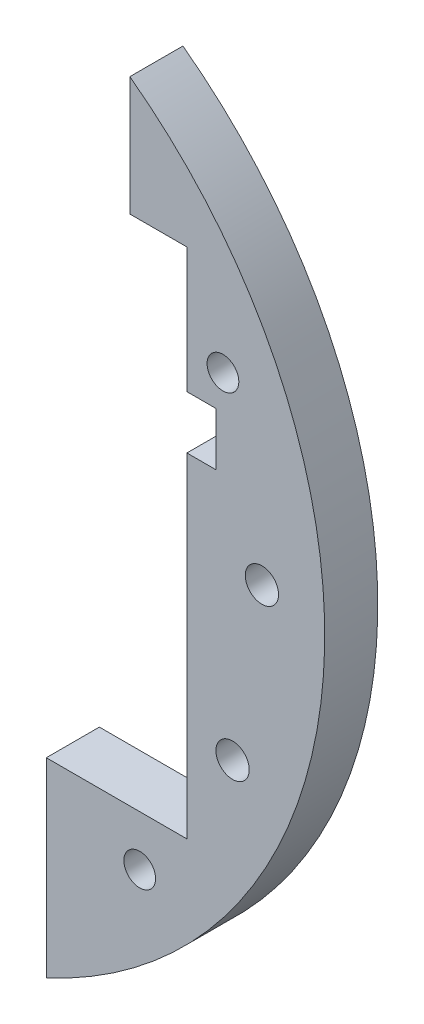
ISO-10303-21;
HEADER;
FILE_DESCRIPTION(('STEP AP214'),'2;1');
FILE_NAME('part.step','',(''),(''),'','','');
FILE_SCHEMA(('AUTOMOTIVE_DESIGN { 1 0 10303 214 1 1 1 1 }'));
ENDSEC;
DATA;
#1=APPLICATION_CONTEXT('core data for automotive mechanical design processes');
#2=APPLICATION_PROTOCOL_DEFINITION('international standard','automotive_design',2000,#1);
#3=PRODUCT_CONTEXT('',#1,'mechanical');
#4=PRODUCT('Part','Part','',(#3));
#5=PRODUCT_RELATED_PRODUCT_CATEGORY('part','',(#4));
#6=PRODUCT_DEFINITION_FORMATION('','',#4);
#7=PRODUCT_DEFINITION_CONTEXT('part definition',#1,'design');
#8=PRODUCT_DEFINITION('design','',#6,#7);
#9=PRODUCT_DEFINITION_SHAPE('','',#8);
#10=(LENGTH_UNIT() NAMED_UNIT(*) SI_UNIT(.MILLI.,.METRE.));
#11=(NAMED_UNIT(*) PLANE_ANGLE_UNIT() SI_UNIT($,.RADIAN.));
#12=(NAMED_UNIT(*) SI_UNIT($,.STERADIAN.) SOLID_ANGLE_UNIT());
#13=UNCERTAINTY_MEASURE_WITH_UNIT(LENGTH_MEASURE(1.E-05),#10,'distance_accuracy_value','');
#14=(GEOMETRIC_REPRESENTATION_CONTEXT(3) GLOBAL_UNCERTAINTY_ASSIGNED_CONTEXT((#13)) GLOBAL_UNIT_ASSIGNED_CONTEXT((#10,
#11,#12)) REPRESENTATION_CONTEXT('',''));
#15=CARTESIAN_POINT('',(0.,0.,0.));
#16=DIRECTION('',(0.,0.,1.));
#17=DIRECTION('',(1.,0.,0.));
#18=AXIS2_PLACEMENT_3D('',#15,#16,#17);
#19=CARTESIAN_POINT('',(0.,0.,6.35));
#20=DIRECTION('',(0.,0.,1.));
#21=DIRECTION('',(1.,0.,0.));
#22=AXIS2_PLACEMENT_3D('',#19,#20,#21);
#23=PLANE('',#22);
#24=CARTESIAN_POINT('',(45.3153893518326,21.1309130870348,6.35));
#25=DIRECTION('',(0.,0.,1.));
#26=DIRECTION('',(1.,0.,0.));
#27=AXIS2_PLACEMENT_3D('',#24,#25,#26);
#28=CIRCLE('',#27,1.89865);
#29=CARTESIAN_POINT('',(47.2140393518326,21.1309130870348,6.35));
#30=VERTEX_POINT('',#29);
#31=EDGE_CURVE('E187',#30,#30,#28,.T.);
#32=ORIENTED_EDGE('',*,*,#31,.F.);
#33=EDGE_LOOP('',(#32));
#34=FACE_BOUND('',#33,.T.);
#35=CARTESIAN_POINT('',(49.97884750411,1.45423593715534,6.35));
#36=DIRECTION('',(0.,0.,1.));
#37=DIRECTION('',(1.,0.,0.));
#38=AXIS2_PLACEMENT_3D('',#35,#36,#37);
#39=CIRCLE('',#38,1.9939);
#40=CARTESIAN_POINT('',(51.97274750411,1.45423593715534,6.35));
#41=VERTEX_POINT('',#40);
#42=EDGE_CURVE('E196',#41,#41,#39,.T.);
#43=ORIENTED_EDGE('',*,*,#42,.F.);
#44=EDGE_LOOP('',(#43));
#45=FACE_BOUND('',#44,.T.);
#46=CARTESIAN_POINT('',(46.4673762113411,-18.4603073656341,6.35));
#47=DIRECTION('',(0.,0.,1.));
#48=DIRECTION('',(1.,0.,0.));
#49=AXIS2_PLACEMENT_3D('',#46,#47,#48);
#50=CIRCLE('',#49,1.9939);
#51=CARTESIAN_POINT('',(48.4612762113412,-18.4603073656341,6.35));
#52=VERTEX_POINT('',#51);
#53=EDGE_CURVE('E190',#52,#52,#50,.T.);
#54=ORIENTED_EDGE('',*,*,#53,.F.);
#55=EDGE_LOOP('',(#54));
#56=FACE_BOUND('',#55,.T.);
#57=CARTESIAN_POINT('',(35.3553390593274,-35.3553390593274,6.35));
#58=DIRECTION('',(0.,0.,1.));
#59=DIRECTION('',(1.,0.,0.));
#60=AXIS2_PLACEMENT_3D('',#57,#58,#59);
#61=CIRCLE('',#60,1.89865);
#62=CARTESIAN_POINT('',(37.2539890593274,-35.3553390593274,6.35));
#63=VERTEX_POINT('',#62);
#64=EDGE_CURVE('E158',#63,#63,#61,.T.);
#65=ORIENTED_EDGE('',*,*,#64,.F.);
#66=EDGE_LOOP('',(#65));
#67=FACE_BOUND('',#66,.T.);
#68=DIRECTION('',(1.,0.,0.));
#69=VECTOR('',#68,1.);
#70=CARTESIAN_POINT('',(12.5,-29.35,6.35));
#71=LINE('',#70,#69);
#72=CARTESIAN_POINT('',(24.175,-29.35,6.35));
#73=VERTEX_POINT('',#72);
#74=CARTESIAN_POINT('',(41.,-29.35,6.35));
#75=VERTEX_POINT('',#74);
#76=EDGE_CURVE('E141',#73,#75,#71,.T.);
#77=ORIENTED_EDGE('',*,*,#76,.F.);
#78=DIRECTION('',(0.,1.,0.));
#79=VECTOR('',#78,1.);
#80=CARTESIAN_POINT('',(24.175,-5.41151692632274,6.35));
#81=LINE('',#80,#79);
#82=CARTESIAN_POINT('',(24.175,-52.1710587874158,6.35));
#83=VERTEX_POINT('',#82);
#84=EDGE_CURVE('E11',#83,#73,#81,.T.);
#85=ORIENTED_EDGE('',*,*,#84,.F.);
#86=CARTESIAN_POINT('',(0.,0.,6.35));
#87=DIRECTION('',(0.,0.,1.));
#88=DIRECTION('',(1.,0.,0.));
#89=AXIS2_PLACEMENT_3D('',#86,#87,#88);
#90=CIRCLE('',#89,57.5);
#91=CARTESIAN_POINT('',(34.175,46.2419655183471,6.35));
#92=VERTEX_POINT('',#91);
#93=EDGE_CURVE('E146',#83,#92,#90,.T.);
#94=ORIENTED_EDGE('',*,*,#93,.T.);
#95=DIRECTION('',(0.,-1.,0.));
#96=VECTOR('',#95,1.);
#97=CARTESIAN_POINT('',(34.175,-8.00000000000004,6.35));
#98=LINE('',#97,#96);
#99=CARTESIAN_POINT('',(34.175,32.,6.35));
#100=VERTEX_POINT('',#99);
#101=EDGE_CURVE('E147',#92,#100,#98,.T.);
#102=ORIENTED_EDGE('',*,*,#101,.T.);
#103=DIRECTION('',(-1.,0.,0.));
#104=VECTOR('',#103,1.);
#105=CARTESIAN_POINT('',(41.,32.,6.35));
#106=LINE('',#105,#104);
#107=CARTESIAN_POINT('',(41.,32.,6.35));
#108=VERTEX_POINT('',#107);
#109=EDGE_CURVE('E121',#108,#100,#106,.T.);
#110=ORIENTED_EDGE('',*,*,#109,.F.);
#111=DIRECTION('',(0.,1.,0.));
#112=VECTOR('',#111,1.);
#113=CARTESIAN_POINT('',(41.,17.,6.35));
#114=LINE('',#113,#112);
#115=CARTESIAN_POINT('',(41.,17.,6.35));
#116=VERTEX_POINT('',#115);
#117=EDGE_CURVE('E168',#116,#108,#114,.T.);
#118=ORIENTED_EDGE('',*,*,#117,.F.);
#119=DIRECTION('',(-1.,0.,0.));
#120=VECTOR('',#119,1.);
#121=CARTESIAN_POINT('',(44.5,17.,6.35));
#122=LINE('',#121,#120);
#123=CARTESIAN_POINT('',(44.5,17.,6.35));
#124=VERTEX_POINT('',#123);
#125=EDGE_CURVE('E165',#124,#116,#122,.T.);
#126=ORIENTED_EDGE('',*,*,#125,.F.);
#127=DIRECTION('',(0.,1.,0.));
#128=VECTOR('',#127,1.);
#129=CARTESIAN_POINT('',(44.5,10.65,6.35));
#130=LINE('',#129,#128);
#131=CARTESIAN_POINT('',(44.5,10.65,6.35));
#132=VERTEX_POINT('',#131);
#133=EDGE_CURVE('E162',#132,#124,#130,.T.);
#134=ORIENTED_EDGE('',*,*,#133,.F.);
#135=DIRECTION('',(1.,0.,0.));
#136=VECTOR('',#135,1.);
#137=CARTESIAN_POINT('',(41.,10.65,6.35));
#138=LINE('',#137,#136);
#139=CARTESIAN_POINT('',(41.,10.65,6.35));
#140=VERTEX_POINT('',#139);
#141=EDGE_CURVE('E159',#140,#132,#138,.T.);
#142=ORIENTED_EDGE('',*,*,#141,.F.);
#143=DIRECTION('',(0.,1.,0.));
#144=VECTOR('',#143,1.);
#145=CARTESIAN_POINT('',(41.,-29.35,6.35));
#146=LINE('',#145,#144);
#147=EDGE_CURVE('E155',#75,#140,#146,.T.);
#148=ORIENTED_EDGE('',*,*,#147,.F.);
#149=EDGE_LOOP('',(#77,#85,#94,#102,#110,#118,#126,#134,#142,#148));
#150=FACE_BOUND('',#149,.T.);
#151=ADVANCED_FACE('F35',(#34,#45,#56,#67,#150),#23,.T.);
#152=CARTESIAN_POINT('',(0.,0.,0.));
#153=DIRECTION('',(0.,0.,1.));
#154=DIRECTION('',(1.,0.,0.));
#155=AXIS2_PLACEMENT_3D('',#152,#153,#154);
#156=PLANE('',#155);
#157=CARTESIAN_POINT('',(45.3153893518326,21.1309130870348,0.));
#158=DIRECTION('',(0.,0.,1.));
#159=DIRECTION('',(1.,0.,0.));
#160=AXIS2_PLACEMENT_3D('',#157,#158,#159);
#161=CIRCLE('',#160,1.89865);
#162=CARTESIAN_POINT('',(47.2140393518326,21.1309130870348,0.));
#163=VERTEX_POINT('',#162);
#164=EDGE_CURVE('E152',#163,#163,#161,.T.);
#165=ORIENTED_EDGE('',*,*,#164,.T.);
#166=EDGE_LOOP('',(#165));
#167=FACE_BOUND('',#166,.T.);
#168=CARTESIAN_POINT('',(49.97884750411,1.45423593715534,0.));
#169=DIRECTION('',(0.,0.,1.));
#170=DIRECTION('',(1.,0.,0.));
#171=AXIS2_PLACEMENT_3D('',#168,#169,#170);
#172=CIRCLE('',#171,1.9939);
#173=CARTESIAN_POINT('',(51.97274750411,1.45423593715534,0.));
#174=VERTEX_POINT('',#173);
#175=EDGE_CURVE('E199',#174,#174,#172,.T.);
#176=ORIENTED_EDGE('',*,*,#175,.T.);
#177=EDGE_LOOP('',(#176));
#178=FACE_BOUND('',#177,.T.);
#179=CARTESIAN_POINT('',(46.4673762113411,-18.4603073656341,0.));
#180=DIRECTION('',(0.,0.,1.));
#181=DIRECTION('',(1.,0.,0.));
#182=AXIS2_PLACEMENT_3D('',#179,#180,#181);
#183=CIRCLE('',#182,1.9939);
#184=CARTESIAN_POINT('',(48.4612762113412,-18.4603073656341,0.));
#185=VERTEX_POINT('',#184);
#186=EDGE_CURVE('E193',#185,#185,#183,.T.);
#187=ORIENTED_EDGE('',*,*,#186,.T.);
#188=EDGE_LOOP('',(#187));
#189=FACE_BOUND('',#188,.T.);
#190=CARTESIAN_POINT('',(35.3553390593274,-35.3553390593274,0.));
#191=DIRECTION('',(0.,0.,1.));
#192=DIRECTION('',(1.,0.,0.));
#193=AXIS2_PLACEMENT_3D('',#190,#191,#192);
#194=CIRCLE('',#193,1.89865);
#195=CARTESIAN_POINT('',(37.2539890593274,-35.3553390593274,0.));
#196=VERTEX_POINT('',#195);
#197=EDGE_CURVE('E150',#196,#196,#194,.T.);
#198=ORIENTED_EDGE('',*,*,#197,.T.);
#199=EDGE_LOOP('',(#198));
#200=FACE_BOUND('',#199,.T.);
#201=DIRECTION('',(0.,1.,0.));
#202=VECTOR('',#201,1.);
#203=CARTESIAN_POINT('',(24.175,-5.41151692632274,0.));
#204=LINE('',#203,#202);
#205=CARTESIAN_POINT('',(24.175,-52.1710587874158,0.));
#206=VERTEX_POINT('',#205);
#207=CARTESIAN_POINT('',(24.175,-29.35,0.));
#208=VERTEX_POINT('',#207);
#209=EDGE_CURVE('E51',#206,#208,#204,.T.);
#210=ORIENTED_EDGE('',*,*,#209,.T.);
#211=DIRECTION('',(1.,0.,0.));
#212=VECTOR('',#211,1.);
#213=CARTESIAN_POINT('',(12.5,-29.35,0.));
#214=LINE('',#213,#212);
#215=CARTESIAN_POINT('',(41.,-29.35,0.));
#216=VERTEX_POINT('',#215);
#217=EDGE_CURVE('E38',#208,#216,#214,.T.);
#218=ORIENTED_EDGE('',*,*,#217,.T.);
#219=DIRECTION('',(0.,1.,0.));
#220=VECTOR('',#219,1.);
#221=CARTESIAN_POINT('',(41.,-29.35,0.));
#222=LINE('',#221,#220);
#223=CARTESIAN_POINT('',(41.,10.65,0.));
#224=VERTEX_POINT('',#223);
#225=EDGE_CURVE('E170',#216,#224,#222,.T.);
#226=ORIENTED_EDGE('',*,*,#225,.T.);
#227=DIRECTION('',(1.,0.,0.));
#228=VECTOR('',#227,1.);
#229=CARTESIAN_POINT('',(41.,10.65,0.));
#230=LINE('',#229,#228);
#231=CARTESIAN_POINT('',(44.5,10.65,0.));
#232=VERTEX_POINT('',#231);
#233=EDGE_CURVE('E173',#224,#232,#230,.T.);
#234=ORIENTED_EDGE('',*,*,#233,.T.);
#235=DIRECTION('',(0.,1.,0.));
#236=VECTOR('',#235,1.);
#237=CARTESIAN_POINT('',(44.5,10.65,0.));
#238=LINE('',#237,#236);
#239=CARTESIAN_POINT('',(44.5,17.,0.));
#240=VERTEX_POINT('',#239);
#241=EDGE_CURVE('E176',#232,#240,#238,.T.);
#242=ORIENTED_EDGE('',*,*,#241,.T.);
#243=DIRECTION('',(-1.,0.,0.));
#244=VECTOR('',#243,1.);
#245=CARTESIAN_POINT('',(44.5,17.,0.));
#246=LINE('',#245,#244);
#247=CARTESIAN_POINT('',(41.,17.,0.));
#248=VERTEX_POINT('',#247);
#249=EDGE_CURVE('E138',#240,#248,#246,.T.);
#250=ORIENTED_EDGE('',*,*,#249,.T.);
#251=DIRECTION('',(0.,1.,0.));
#252=VECTOR('',#251,1.);
#253=CARTESIAN_POINT('',(41.,17.,0.));
#254=LINE('',#253,#252);
#255=CARTESIAN_POINT('',(41.,32.,0.));
#256=VERTEX_POINT('',#255);
#257=EDGE_CURVE('E135',#248,#256,#254,.T.);
#258=ORIENTED_EDGE('',*,*,#257,.T.);
#259=DIRECTION('',(-1.,0.,0.));
#260=VECTOR('',#259,1.);
#261=CARTESIAN_POINT('',(41.,32.,0.));
#262=LINE('',#261,#260);
#263=CARTESIAN_POINT('',(34.175,32.,0.));
#264=VERTEX_POINT('',#263);
#265=EDGE_CURVE('E128',#256,#264,#262,.T.);
#266=ORIENTED_EDGE('',*,*,#265,.T.);
#267=DIRECTION('',(0.,-1.,0.));
#268=VECTOR('',#267,1.);
#269=CARTESIAN_POINT('',(34.175,-8.00000000000004,0.));
#270=LINE('',#269,#268);
#271=CARTESIAN_POINT('',(34.175,46.2419655183471,0.));
#272=VERTEX_POINT('',#271);
#273=EDGE_CURVE('E110',#272,#264,#270,.T.);
#274=ORIENTED_EDGE('',*,*,#273,.F.);
#275=CARTESIAN_POINT('',(0.,0.,0.));
#276=DIRECTION('',(0.,0.,1.));
#277=DIRECTION('',(1.,0.,0.));
#278=AXIS2_PLACEMENT_3D('',#275,#276,#277);
#279=CIRCLE('',#278,57.5);
#280=EDGE_CURVE('E136',#206,#272,#279,.T.);
#281=ORIENTED_EDGE('',*,*,#280,.F.);
#282=EDGE_LOOP('',(#210,#218,#226,#234,#242,#250,#258,#266,#274,#281));
#283=FACE_BOUND('',#282,.T.);
#284=ADVANCED_FACE('F132',(#167,#178,#189,#200,#283),#156,.F.);
#285=CARTESIAN_POINT('',(0.,0.,6.35));
#286=DIRECTION('',(0.,0.,-1.));
#287=DIRECTION('',(-1.,0.,0.));
#288=AXIS2_PLACEMENT_3D('',#285,#286,#287);
#289=CYLINDRICAL_SURFACE('',#288,57.5);
#290=DIRECTION('',(0.,0.,-1.));
#291=VECTOR('',#290,1.);
#292=CARTESIAN_POINT('',(24.175,-52.1710587874158,6.35));
#293=LINE('',#292,#291);
#294=EDGE_CURVE('E43',#206,#83,#293,.F.);
#295=ORIENTED_EDGE('',*,*,#294,.F.);
#296=ORIENTED_EDGE('',*,*,#280,.T.);
#297=DIRECTION('',(0.,0.,-1.));
#298=VECTOR('',#297,1.);
#299=CARTESIAN_POINT('',(34.175,46.2419655183471,6.35));
#300=LINE('',#299,#298);
#301=EDGE_CURVE('E117',#272,#92,#300,.F.);
#302=ORIENTED_EDGE('',*,*,#301,.T.);
#303=ORIENTED_EDGE('',*,*,#93,.F.);
#304=EDGE_LOOP('',(#295,#296,#302,#303));
#305=FACE_BOUND('',#304,.T.);
#306=ADVANCED_FACE('F229',(#305),#289,.T.);
#307=CARTESIAN_POINT('',(12.5,-29.35,6.35));
#308=DIRECTION('',(0.,1.,0.));
#309=DIRECTION('',(0.,0.,1.));
#310=AXIS2_PLACEMENT_3D('',#307,#308,#309);
#311=PLANE('',#310);
#312=ORIENTED_EDGE('',*,*,#217,.F.);
#313=DIRECTION('',(0.,0.,1.));
#314=VECTOR('',#313,1.);
#315=CARTESIAN_POINT('',(24.175,-29.35,6.35));
#316=LINE('',#315,#314);
#317=EDGE_CURVE('E55',#208,#73,#316,.T.);
#318=ORIENTED_EDGE('',*,*,#317,.T.);
#319=ORIENTED_EDGE('',*,*,#76,.T.);
#320=DIRECTION('',(0.,0.,-1.));
#321=VECTOR('',#320,1.);
#322=CARTESIAN_POINT('',(41.,-29.35,6.35));
#323=LINE('',#322,#321);
#324=EDGE_CURVE('E143',#75,#216,#323,.T.);
#325=ORIENTED_EDGE('',*,*,#324,.T.);
#326=EDGE_LOOP('',(#312,#318,#319,#325));
#327=FACE_BOUND('',#326,.T.);
#328=ADVANCED_FACE('F211',(#327),#311,.T.);
#329=CARTESIAN_POINT('',(45.3153893518326,21.1309130870348,6.35));
#330=DIRECTION('',(0.,0.,-1.));
#331=DIRECTION('',(-1.,0.,0.));
#332=AXIS2_PLACEMENT_3D('',#329,#330,#331);
#333=CYLINDRICAL_SURFACE('',#332,1.89865);
#334=ORIENTED_EDGE('',*,*,#31,.T.);
#335=EDGE_LOOP('',(#334));
#336=FACE_BOUND('',#335,.T.);
#337=ORIENTED_EDGE('',*,*,#164,.F.);
#338=EDGE_LOOP('',(#337));
#339=FACE_BOUND('',#338,.T.);
#340=ADVANCED_FACE('F295',(#336,#339),#333,.F.);
#341=CARTESIAN_POINT('',(49.97884750411,1.45423593715534,6.35));
#342=DIRECTION('',(0.,0.,-1.));
#343=DIRECTION('',(-1.,0.,0.));
#344=AXIS2_PLACEMENT_3D('',#341,#342,#343);
#345=CYLINDRICAL_SURFACE('',#344,1.9939);
#346=ORIENTED_EDGE('',*,*,#42,.T.);
#347=EDGE_LOOP('',(#346));
#348=FACE_BOUND('',#347,.T.);
#349=ORIENTED_EDGE('',*,*,#175,.F.);
#350=EDGE_LOOP('',(#349));
#351=FACE_BOUND('',#350,.T.);
#352=ADVANCED_FACE('F264',(#348,#351),#345,.F.);
#353=CARTESIAN_POINT('',(46.4673762113411,-18.4603073656341,6.35));
#354=DIRECTION('',(0.,0.,-1.));
#355=DIRECTION('',(-1.,0.,0.));
#356=AXIS2_PLACEMENT_3D('',#353,#354,#355);
#357=CYLINDRICAL_SURFACE('',#356,1.9939);
#358=ORIENTED_EDGE('',*,*,#53,.T.);
#359=EDGE_LOOP('',(#358));
#360=FACE_BOUND('',#359,.T.);
#361=ORIENTED_EDGE('',*,*,#186,.F.);
#362=EDGE_LOOP('',(#361));
#363=FACE_BOUND('',#362,.T.);
#364=ADVANCED_FACE('F255',(#360,#363),#357,.F.);
#365=CARTESIAN_POINT('',(35.3553390593274,-35.3553390593274,6.35));
#366=DIRECTION('',(0.,0.,-1.));
#367=DIRECTION('',(-1.,0.,0.));
#368=AXIS2_PLACEMENT_3D('',#365,#366,#367);
#369=CYLINDRICAL_SURFACE('',#368,1.89865);
#370=ORIENTED_EDGE('',*,*,#64,.T.);
#371=EDGE_LOOP('',(#370));
#372=FACE_BOUND('',#371,.T.);
#373=ORIENTED_EDGE('',*,*,#197,.F.);
#374=EDGE_LOOP('',(#373));
#375=FACE_BOUND('',#374,.T.);
#376=ADVANCED_FACE('F252',(#372,#375),#369,.F.);
#377=CARTESIAN_POINT('',(41.,-29.35,6.35));
#378=DIRECTION('',(-1.,0.,0.));
#379=DIRECTION('',(0.,-1.,0.));
#380=AXIS2_PLACEMENT_3D('',#377,#378,#379);
#381=PLANE('',#380);
#382=ORIENTED_EDGE('',*,*,#225,.F.);
#383=ORIENTED_EDGE('',*,*,#324,.F.);
#384=ORIENTED_EDGE('',*,*,#147,.T.);
#385=DIRECTION('',(0.,0.,-1.));
#386=VECTOR('',#385,1.);
#387=CARTESIAN_POINT('',(41.,10.65,6.35));
#388=LINE('',#387,#386);
#389=EDGE_CURVE('E157',#140,#224,#388,.T.);
#390=ORIENTED_EDGE('',*,*,#389,.T.);
#391=EDGE_LOOP('',(#382,#383,#384,#390));
#392=FACE_BOUND('',#391,.T.);
#393=ADVANCED_FACE('F222',(#392),#381,.T.);
#394=CARTESIAN_POINT('',(41.,10.65,6.35));
#395=DIRECTION('',(0.,1.,0.));
#396=DIRECTION('',(-1.,0.,0.));
#397=AXIS2_PLACEMENT_3D('',#394,#395,#396);
#398=PLANE('',#397);
#399=ORIENTED_EDGE('',*,*,#233,.F.);
#400=ORIENTED_EDGE('',*,*,#389,.F.);
#401=ORIENTED_EDGE('',*,*,#141,.T.);
#402=DIRECTION('',(0.,0.,-1.));
#403=VECTOR('',#402,1.);
#404=CARTESIAN_POINT('',(44.5,10.65,6.35));
#405=LINE('',#404,#403);
#406=EDGE_CURVE('E161',#132,#232,#405,.T.);
#407=ORIENTED_EDGE('',*,*,#406,.T.);
#408=EDGE_LOOP('',(#399,#400,#401,#407));
#409=FACE_BOUND('',#408,.T.);
#410=ADVANCED_FACE('F225',(#409),#398,.T.);
#411=CARTESIAN_POINT('',(44.5,10.65,6.35));
#412=DIRECTION('',(-1.,0.,0.));
#413=DIRECTION('',(0.,0.,1.));
#414=AXIS2_PLACEMENT_3D('',#411,#412,#413);
#415=PLANE('',#414);
#416=ORIENTED_EDGE('',*,*,#241,.F.);
#417=ORIENTED_EDGE('',*,*,#406,.F.);
#418=ORIENTED_EDGE('',*,*,#133,.T.);
#419=DIRECTION('',(0.,0.,-1.));
#420=VECTOR('',#419,1.);
#421=CARTESIAN_POINT('',(44.5,17.,6.35));
#422=LINE('',#421,#420);
#423=EDGE_CURVE('E164',#124,#240,#422,.T.);
#424=ORIENTED_EDGE('',*,*,#423,.T.);
#425=EDGE_LOOP('',(#416,#417,#418,#424));
#426=FACE_BOUND('',#425,.T.);
#427=ADVANCED_FACE('F271',(#426),#415,.T.);
#428=CARTESIAN_POINT('',(44.5,17.,6.35));
#429=DIRECTION('',(0.,-1.,0.));
#430=DIRECTION('',(0.,0.,-1.));
#431=AXIS2_PLACEMENT_3D('',#428,#429,#430);
#432=PLANE('',#431);
#433=ORIENTED_EDGE('',*,*,#249,.F.);
#434=ORIENTED_EDGE('',*,*,#423,.F.);
#435=ORIENTED_EDGE('',*,*,#125,.T.);
#436=DIRECTION('',(0.,0.,-1.));
#437=VECTOR('',#436,1.);
#438=CARTESIAN_POINT('',(41.,17.,6.35));
#439=LINE('',#438,#437);
#440=EDGE_CURVE('E167',#116,#248,#439,.T.);
#441=ORIENTED_EDGE('',*,*,#440,.T.);
#442=EDGE_LOOP('',(#433,#434,#435,#441));
#443=FACE_BOUND('',#442,.T.);
#444=ADVANCED_FACE('F274',(#443),#432,.T.);
#445=CARTESIAN_POINT('',(41.,17.,6.35));
#446=DIRECTION('',(-1.,0.,0.));
#447=DIRECTION('',(0.,0.,1.));
#448=AXIS2_PLACEMENT_3D('',#445,#446,#447);
#449=PLANE('',#448);
#450=ORIENTED_EDGE('',*,*,#257,.F.);
#451=ORIENTED_EDGE('',*,*,#440,.F.);
#452=ORIENTED_EDGE('',*,*,#117,.T.);
#453=DIRECTION('',(0.,0.,-1.));
#454=VECTOR('',#453,1.);
#455=CARTESIAN_POINT('',(41.,32.,6.35));
#456=LINE('',#455,#454);
#457=EDGE_CURVE('E144',#108,#256,#456,.T.);
#458=ORIENTED_EDGE('',*,*,#457,.T.);
#459=EDGE_LOOP('',(#450,#451,#452,#458));
#460=FACE_BOUND('',#459,.T.);
#461=ADVANCED_FACE('F278',(#460),#449,.T.);
#462=CARTESIAN_POINT('',(41.,32.,6.35));
#463=DIRECTION('',(0.,-1.,0.));
#464=DIRECTION('',(0.,0.,-1.));
#465=AXIS2_PLACEMENT_3D('',#462,#463,#464);
#466=PLANE('',#465);
#467=DIRECTION('',(0.,0.,1.));
#468=VECTOR('',#467,1.);
#469=CARTESIAN_POINT('',(34.175,32.,6.35));
#470=LINE('',#469,#468);
#471=EDGE_CURVE('E114',#264,#100,#470,.T.);
#472=ORIENTED_EDGE('',*,*,#471,.F.);
#473=ORIENTED_EDGE('',*,*,#265,.F.);
#474=ORIENTED_EDGE('',*,*,#457,.F.);
#475=ORIENTED_EDGE('',*,*,#109,.T.);
#476=EDGE_LOOP('',(#472,#473,#474,#475));
#477=FACE_BOUND('',#476,.T.);
#478=ADVANCED_FACE('F126',(#477),#466,.T.);
#479=CARTESIAN_POINT('',(34.175,-8.00000000000004,6.35));
#480=DIRECTION('',(1.,0.,0.));
#481=DIRECTION('',(0.,0.,-1.));
#482=AXIS2_PLACEMENT_3D('',#479,#480,#481);
#483=PLANE('',#482);
#484=ORIENTED_EDGE('',*,*,#273,.T.);
#485=ORIENTED_EDGE('',*,*,#471,.T.);
#486=ORIENTED_EDGE('',*,*,#101,.F.);
#487=ORIENTED_EDGE('',*,*,#301,.F.);
#488=EDGE_LOOP('',(#484,#485,#486,#487));
#489=FACE_BOUND('',#488,.T.);
#490=ADVANCED_FACE('F112',(#489),#483,.F.);
#491=CARTESIAN_POINT('',(24.175,-5.41151692632274,6.35));
#492=DIRECTION('',(-1.,0.,0.));
#493=DIRECTION('',(0.,-1.,0.));
#494=AXIS2_PLACEMENT_3D('',#491,#492,#493);
#495=PLANE('',#494);
#496=ORIENTED_EDGE('',*,*,#294,.T.);
#497=ORIENTED_EDGE('',*,*,#84,.T.);
#498=ORIENTED_EDGE('',*,*,#317,.F.);
#499=ORIENTED_EDGE('',*,*,#209,.F.);
#500=EDGE_LOOP('',(#496,#497,#498,#499));
#501=FACE_BOUND('',#500,.T.);
#502=ADVANCED_FACE('F230',(#501),#495,.T.);
#503=CLOSED_SHELL('',(#151,#284,#306,#328,#340,#352,#364,#376,#393,#410,#427,#444,#461,#478,
#490,#502));
#504=MANIFOLD_SOLID_BREP('B2',#503);
#505=ADVANCED_BREP_SHAPE_REPRESENTATION('',(#18,#504),#14);
#506=SHAPE_DEFINITION_REPRESENTATION(#9,#505);
ENDSEC;
END-ISO-10303-21;
